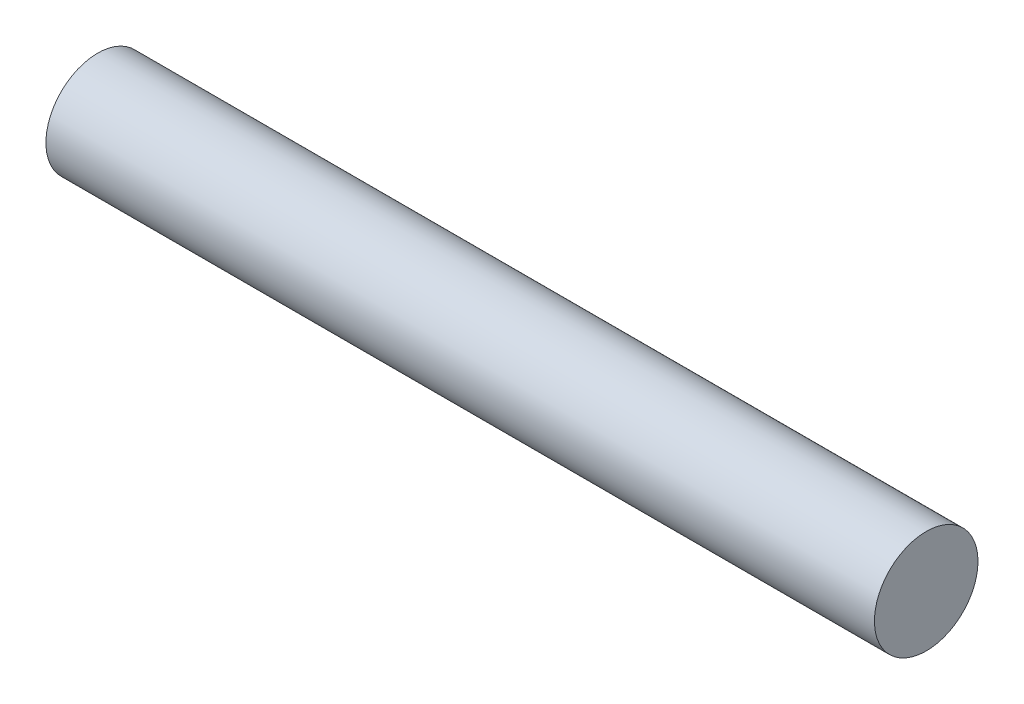
ISO-10303-21;
HEADER;
FILE_DESCRIPTION(('STEP AP214'),'2;1');
FILE_NAME('part.step','',(''),(''),'','','');
FILE_SCHEMA(('AUTOMOTIVE_DESIGN { 1 0 10303 214 1 1 1 1 }'));
ENDSEC;
DATA;
#1=APPLICATION_CONTEXT('core data for automotive mechanical design processes');
#2=APPLICATION_PROTOCOL_DEFINITION('international standard','automotive_design',2000,#1);
#3=PRODUCT_CONTEXT('',#1,'mechanical');
#4=PRODUCT('Part','Part','',(#3));
#5=PRODUCT_RELATED_PRODUCT_CATEGORY('part','',(#4));
#6=PRODUCT_DEFINITION_FORMATION('','',#4);
#7=PRODUCT_DEFINITION_CONTEXT('part definition',#1,'design');
#8=PRODUCT_DEFINITION('design','',#6,#7);
#9=PRODUCT_DEFINITION_SHAPE('','',#8);
#10=(LENGTH_UNIT() NAMED_UNIT(*) SI_UNIT(.MILLI.,.METRE.));
#11=(NAMED_UNIT(*) PLANE_ANGLE_UNIT() SI_UNIT($,.RADIAN.));
#12=(NAMED_UNIT(*) SI_UNIT($,.STERADIAN.) SOLID_ANGLE_UNIT());
#13=UNCERTAINTY_MEASURE_WITH_UNIT(LENGTH_MEASURE(1.E-05),#10,'distance_accuracy_value','');
#14=(GEOMETRIC_REPRESENTATION_CONTEXT(3) GLOBAL_UNCERTAINTY_ASSIGNED_CONTEXT((#13)) GLOBAL_UNIT_ASSIGNED_CONTEXT((#10,
#11,#12)) REPRESENTATION_CONTEXT('',''));
#15=CARTESIAN_POINT('',(0.,0.,0.));
#16=DIRECTION('',(0.,0.,1.));
#17=DIRECTION('',(1.,0.,0.));
#18=AXIS2_PLACEMENT_3D('',#15,#16,#17);
#19=CARTESIAN_POINT('',(40.,0.,0.));
#20=DIRECTION('',(-1.,0.,0.));
#21=DIRECTION('',(0.,0.,1.));
#22=AXIS2_PLACEMENT_3D('',#19,#20,#21);
#23=CYLINDRICAL_SURFACE('',#22,2.5);
#24=CARTESIAN_POINT('',(40.,0.,0.));
#25=DIRECTION('',(1.,0.,0.));
#26=DIRECTION('',(0.,0.,-1.));
#27=AXIS2_PLACEMENT_3D('',#24,#25,#26);
#28=CIRCLE('',#27,2.5);
#29=CARTESIAN_POINT('',(40.,0.,-2.5));
#30=VERTEX_POINT('',#29);
#31=EDGE_CURVE('E10',#30,#30,#28,.T.);
#32=ORIENTED_EDGE('',*,*,#31,.F.);
#33=EDGE_LOOP('',(#32));
#34=FACE_BOUND('',#33,.T.);
#35=CARTESIAN_POINT('',(0.,0.,0.));
#36=DIRECTION('',(1.,0.,0.));
#37=DIRECTION('',(0.,0.,-1.));
#38=AXIS2_PLACEMENT_3D('',#35,#36,#37);
#39=CIRCLE('',#38,2.5);
#40=CARTESIAN_POINT('',(0.,0.,-2.5));
#41=VERTEX_POINT('',#40);
#42=EDGE_CURVE('E33',#41,#41,#39,.T.);
#43=ORIENTED_EDGE('',*,*,#42,.T.);
#44=EDGE_LOOP('',(#43));
#45=FACE_BOUND('',#44,.T.);
#46=ADVANCED_FACE('F30',(#34,#45),#23,.T.);
#47=CARTESIAN_POINT('',(40.,0.,0.));
#48=DIRECTION('',(1.,0.,0.));
#49=DIRECTION('',(0.,0.,-1.));
#50=AXIS2_PLACEMENT_3D('',#47,#48,#49);
#51=PLANE('',#50);
#52=ORIENTED_EDGE('',*,*,#31,.T.);
#53=EDGE_LOOP('',(#52));
#54=FACE_BOUND('',#53,.T.);
#55=ADVANCED_FACE('F45',(#54),#51,.T.);
#56=CARTESIAN_POINT('',(0.,0.,0.));
#57=DIRECTION('',(1.,0.,0.));
#58=DIRECTION('',(0.,0.,-1.));
#59=AXIS2_PLACEMENT_3D('',#56,#57,#58);
#60=PLANE('',#59);
#61=ORIENTED_EDGE('',*,*,#42,.F.);
#62=EDGE_LOOP('',(#61));
#63=FACE_BOUND('',#62,.T.);
#64=ADVANCED_FACE('F43',(#63),#60,.F.);
#65=CLOSED_SHELL('',(#46,#55,#64));
#66=MANIFOLD_SOLID_BREP('B2',#65);
#67=ADVANCED_BREP_SHAPE_REPRESENTATION('',(#18,#66),#14);
#68=SHAPE_DEFINITION_REPRESENTATION(#9,#67);
ENDSEC;
END-ISO-10303-21;
